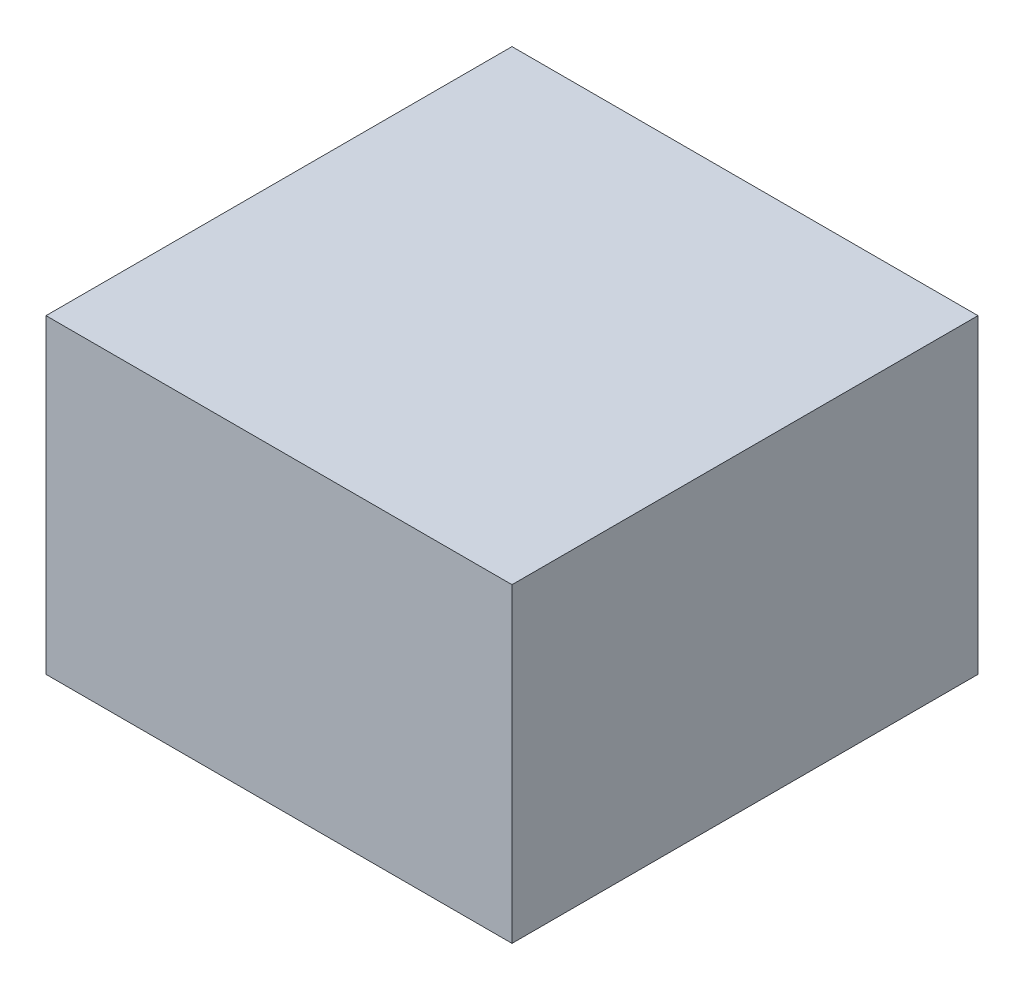
ISO-10303-21;
HEADER;
FILE_DESCRIPTION(('STEP AP214'),'2;1');
FILE_NAME('part.step','',(''),(''),'','','');
FILE_SCHEMA(('AUTOMOTIVE_DESIGN { 1 0 10303 214 1 1 1 1 }'));
ENDSEC;
DATA;
#1=APPLICATION_CONTEXT('core data for automotive mechanical design processes');
#2=APPLICATION_PROTOCOL_DEFINITION('international standard','automotive_design',2000,#1);
#3=PRODUCT_CONTEXT('',#1,'mechanical');
#4=PRODUCT('Part','Part','',(#3));
#5=PRODUCT_RELATED_PRODUCT_CATEGORY('part','',(#4));
#6=PRODUCT_DEFINITION_FORMATION('','',#4);
#7=PRODUCT_DEFINITION_CONTEXT('part definition',#1,'design');
#8=PRODUCT_DEFINITION('design','',#6,#7);
#9=PRODUCT_DEFINITION_SHAPE('','',#8);
#10=(LENGTH_UNIT() NAMED_UNIT(*) SI_UNIT(.MILLI.,.METRE.));
#11=(NAMED_UNIT(*) PLANE_ANGLE_UNIT() SI_UNIT($,.RADIAN.));
#12=(NAMED_UNIT(*) SI_UNIT($,.STERADIAN.) SOLID_ANGLE_UNIT());
#13=UNCERTAINTY_MEASURE_WITH_UNIT(LENGTH_MEASURE(1.E-05),#10,'distance_accuracy_value','');
#14=(GEOMETRIC_REPRESENTATION_CONTEXT(3) GLOBAL_UNCERTAINTY_ASSIGNED_CONTEXT((#13)) GLOBAL_UNIT_ASSIGNED_CONTEXT((#10,
#11,#12)) REPRESENTATION_CONTEXT('',''));
#15=CARTESIAN_POINT('',(0.,0.,0.));
#16=DIRECTION('',(0.,0.,1.));
#17=DIRECTION('',(1.,0.,0.));
#18=AXIS2_PLACEMENT_3D('',#15,#16,#17);
#19=CARTESIAN_POINT('',(0.,100.,0.));
#20=DIRECTION('',(-1.,0.,0.));
#21=DIRECTION('',(0.,0.,1.));
#22=AXIS2_PLACEMENT_3D('',#19,#20,#21);
#23=PLANE('',#22);
#24=DIRECTION('',(0.,0.,-1.));
#25=VECTOR('',#24,1.);
#26=CARTESIAN_POINT('',(0.,0.,0.));
#27=LINE('',#26,#25);
#28=CARTESIAN_POINT('',(0.,0.,0.));
#29=VERTEX_POINT('',#28);
#30=CARTESIAN_POINT('',(0.,0.,-150.));
#31=VERTEX_POINT('',#30);
#32=EDGE_CURVE('E76',#29,#31,#27,.T.);
#33=ORIENTED_EDGE('',*,*,#32,.T.);
#34=DIRECTION('',(0.,-1.,0.));
#35=VECTOR('',#34,1.);
#36=CARTESIAN_POINT('',(0.,100.,-150.));
#37=LINE('',#36,#35);
#38=CARTESIAN_POINT('',(0.,100.,-150.));
#39=VERTEX_POINT('',#38);
#40=EDGE_CURVE('E11',#39,#31,#37,.T.);
#41=ORIENTED_EDGE('',*,*,#40,.F.);
#42=DIRECTION('',(0.,0.,-1.));
#43=VECTOR('',#42,1.);
#44=CARTESIAN_POINT('',(0.,100.,0.));
#45=LINE('',#44,#43);
#46=CARTESIAN_POINT('',(0.,100.,0.));
#47=VERTEX_POINT('',#46);
#48=EDGE_CURVE('E94',#47,#39,#45,.T.);
#49=ORIENTED_EDGE('',*,*,#48,.F.);
#50=DIRECTION('',(0.,-1.,0.));
#51=VECTOR('',#50,1.);
#52=CARTESIAN_POINT('',(0.,100.,0.));
#53=LINE('',#52,#51);
#54=EDGE_CURVE('E88',#47,#29,#53,.T.);
#55=ORIENTED_EDGE('',*,*,#54,.T.);
#56=EDGE_LOOP('',(#33,#41,#49,#55));
#57=FACE_BOUND('',#56,.T.);
#58=ADVANCED_FACE('F32',(#57),#23,.F.);
#59=CARTESIAN_POINT('',(0.,100.,-150.));
#60=DIRECTION('',(0.,0.,1.));
#61=DIRECTION('',(1.,0.,0.));
#62=AXIS2_PLACEMENT_3D('',#59,#60,#61);
#63=PLANE('',#62);
#64=DIRECTION('',(-1.,0.,0.));
#65=VECTOR('',#64,1.);
#66=CARTESIAN_POINT('',(0.,0.,-150.));
#67=LINE('',#66,#65);
#68=CARTESIAN_POINT('',(-150.,0.,-150.));
#69=VERTEX_POINT('',#68);
#70=EDGE_CURVE('E72',#31,#69,#67,.T.);
#71=ORIENTED_EDGE('',*,*,#70,.T.);
#72=DIRECTION('',(0.,-1.,0.));
#73=VECTOR('',#72,1.);
#74=CARTESIAN_POINT('',(-150.,100.,-150.));
#75=LINE('',#74,#73);
#76=CARTESIAN_POINT('',(-150.,100.,-150.));
#77=VERTEX_POINT('',#76);
#78=EDGE_CURVE('E39',#77,#69,#75,.T.);
#79=ORIENTED_EDGE('',*,*,#78,.F.);
#80=DIRECTION('',(-1.,0.,0.));
#81=VECTOR('',#80,1.);
#82=CARTESIAN_POINT('',(0.,100.,-150.));
#83=LINE('',#82,#81);
#84=EDGE_CURVE('E84',#39,#77,#83,.T.);
#85=ORIENTED_EDGE('',*,*,#84,.F.);
#86=ORIENTED_EDGE('',*,*,#40,.T.);
#87=EDGE_LOOP('',(#71,#79,#85,#86));
#88=FACE_BOUND('',#87,.T.);
#89=ADVANCED_FACE('F83',(#88),#63,.F.);
#90=CARTESIAN_POINT('',(-150.,100.,0.));
#91=DIRECTION('',(1.,0.,0.));
#92=DIRECTION('',(0.,0.,-1.));
#93=AXIS2_PLACEMENT_3D('',#90,#91,#92);
#94=PLANE('',#93);
#95=DIRECTION('',(0.,0.,1.));
#96=VECTOR('',#95,1.);
#97=CARTESIAN_POINT('',(-150.,0.,0.));
#98=LINE('',#97,#96);
#99=CARTESIAN_POINT('',(-150.,0.,0.));
#100=VERTEX_POINT('',#99);
#101=EDGE_CURVE('E77',#69,#100,#98,.T.);
#102=ORIENTED_EDGE('',*,*,#101,.T.);
#103=DIRECTION('',(0.,-1.,0.));
#104=VECTOR('',#103,1.);
#105=CARTESIAN_POINT('',(-150.,100.,0.));
#106=LINE('',#105,#104);
#107=CARTESIAN_POINT('',(-150.,100.,0.));
#108=VERTEX_POINT('',#107);
#109=EDGE_CURVE('E100',#108,#100,#106,.T.);
#110=ORIENTED_EDGE('',*,*,#109,.F.);
#111=DIRECTION('',(0.,0.,1.));
#112=VECTOR('',#111,1.);
#113=CARTESIAN_POINT('',(-150.,100.,0.));
#114=LINE('',#113,#112);
#115=EDGE_CURVE('E51',#77,#108,#114,.T.);
#116=ORIENTED_EDGE('',*,*,#115,.F.);
#117=ORIENTED_EDGE('',*,*,#78,.T.);
#118=EDGE_LOOP('',(#102,#110,#116,#117));
#119=FACE_BOUND('',#118,.T.);
#120=ADVANCED_FACE('F103',(#119),#94,.F.);
#121=CARTESIAN_POINT('',(0.,100.,0.));
#122=DIRECTION('',(0.,0.,-1.));
#123=DIRECTION('',(-1.,0.,0.));
#124=AXIS2_PLACEMENT_3D('',#121,#122,#123);
#125=PLANE('',#124);
#126=DIRECTION('',(1.,0.,0.));
#127=VECTOR('',#126,1.);
#128=CARTESIAN_POINT('',(0.,0.,0.));
#129=LINE('',#128,#127);
#130=EDGE_CURVE('E92',#100,#29,#129,.T.);
#131=ORIENTED_EDGE('',*,*,#130,.T.);
#132=ORIENTED_EDGE('',*,*,#54,.F.);
#133=DIRECTION('',(1.,0.,0.));
#134=VECTOR('',#133,1.);
#135=CARTESIAN_POINT('',(0.,100.,0.));
#136=LINE('',#135,#134);
#137=EDGE_CURVE('E46',#108,#47,#136,.T.);
#138=ORIENTED_EDGE('',*,*,#137,.F.);
#139=ORIENTED_EDGE('',*,*,#109,.T.);
#140=EDGE_LOOP('',(#131,#132,#138,#139));
#141=FACE_BOUND('',#140,.T.);
#142=ADVANCED_FACE('F105',(#141),#125,.F.);
#143=CARTESIAN_POINT('',(0.,100.,0.));
#144=DIRECTION('',(0.,1.,0.));
#145=DIRECTION('',(0.,0.,1.));
#146=AXIS2_PLACEMENT_3D('',#143,#144,#145);
#147=PLANE('',#146);
#148=ORIENTED_EDGE('',*,*,#48,.T.);
#149=ORIENTED_EDGE('',*,*,#84,.T.);
#150=ORIENTED_EDGE('',*,*,#115,.T.);
#151=ORIENTED_EDGE('',*,*,#137,.T.);
#152=EDGE_LOOP('',(#148,#149,#150,#151));
#153=FACE_BOUND('',#152,.T.);
#154=ADVANCED_FACE('F106',(#153),#147,.T.);
#155=CARTESIAN_POINT('',(0.,0.,0.));
#156=DIRECTION('',(0.,1.,0.));
#157=DIRECTION('',(0.,0.,1.));
#158=AXIS2_PLACEMENT_3D('',#155,#156,#157);
#159=PLANE('',#158);
#160=ORIENTED_EDGE('',*,*,#32,.F.);
#161=ORIENTED_EDGE('',*,*,#130,.F.);
#162=ORIENTED_EDGE('',*,*,#101,.F.);
#163=ORIENTED_EDGE('',*,*,#70,.F.);
#164=EDGE_LOOP('',(#160,#161,#162,#163));
#165=FACE_BOUND('',#164,.T.);
#166=ADVANCED_FACE('F73',(#165),#159,.F.);
#167=CLOSED_SHELL('',(#58,#89,#120,#142,#154,#166));
#168=MANIFOLD_SOLID_BREP('B2',#167);
#169=ADVANCED_BREP_SHAPE_REPRESENTATION('',(#18,#168),#14);
#170=SHAPE_DEFINITION_REPRESENTATION(#9,#169);
ENDSEC;
END-ISO-10303-21;
